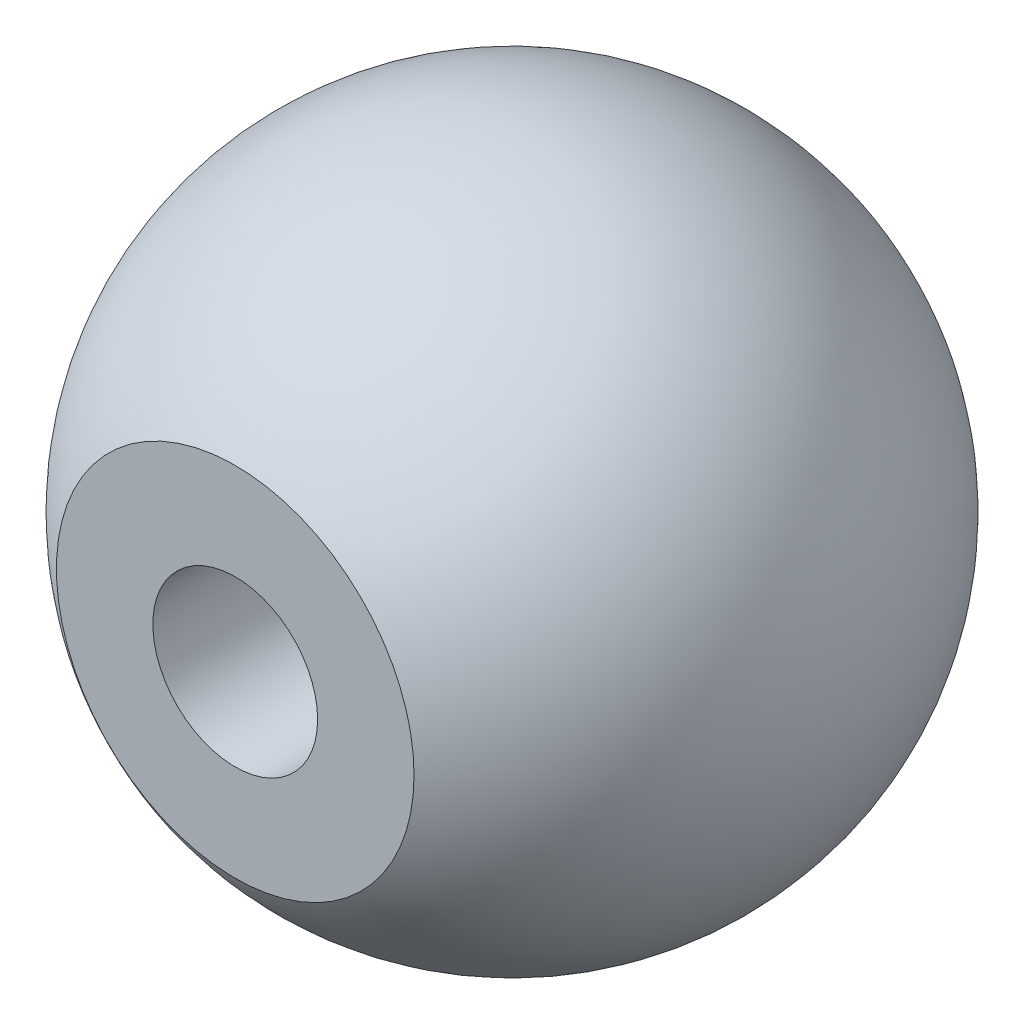
ISO-10303-21;
HEADER;
FILE_DESCRIPTION(('STEP AP214'),'2;1');
FILE_NAME('part.step','',(''),(''),'','','');
FILE_SCHEMA(('AUTOMOTIVE_DESIGN { 1 0 10303 214 1 1 1 1 }'));
ENDSEC;
DATA;
#1=APPLICATION_CONTEXT('core data for automotive mechanical design processes');
#2=APPLICATION_PROTOCOL_DEFINITION('international standard','automotive_design',2000,#1);
#3=PRODUCT_CONTEXT('',#1,'mechanical');
#4=PRODUCT('Part','Part','',(#3));
#5=PRODUCT_RELATED_PRODUCT_CATEGORY('part','',(#4));
#6=PRODUCT_DEFINITION_FORMATION('','',#4);
#7=PRODUCT_DEFINITION_CONTEXT('part definition',#1,'design');
#8=PRODUCT_DEFINITION('design','',#6,#7);
#9=PRODUCT_DEFINITION_SHAPE('','',#8);
#10=(LENGTH_UNIT() NAMED_UNIT(*) SI_UNIT(.MILLI.,.METRE.));
#11=(NAMED_UNIT(*) PLANE_ANGLE_UNIT() SI_UNIT($,.RADIAN.));
#12=(NAMED_UNIT(*) SI_UNIT($,.STERADIAN.) SOLID_ANGLE_UNIT());
#13=UNCERTAINTY_MEASURE_WITH_UNIT(LENGTH_MEASURE(1.E-05),#10,'distance_accuracy_value','');
#14=(GEOMETRIC_REPRESENTATION_CONTEXT(3) GLOBAL_UNCERTAINTY_ASSIGNED_CONTEXT((#13)) GLOBAL_UNIT_ASSIGNED_CONTEXT((#10,
#11,#12)) REPRESENTATION_CONTEXT('',''));
#15=CARTESIAN_POINT('',(0.,0.,0.));
#16=DIRECTION('',(0.,0.,1.));
#17=DIRECTION('',(1.,0.,0.));
#18=AXIS2_PLACEMENT_3D('',#15,#16,#17);
#19=CARTESIAN_POINT('',(0.,0.,0.));
#20=DIRECTION('',(-1.,0.,0.));
#21=DIRECTION('',(0.,0.,-1.));
#22=AXIS2_PLACEMENT_3D('',#19,#20,#21);
#23=SPHERICAL_SURFACE('',#22,19.05);
#24=CARTESIAN_POINT('',(0.,0.,0.));
#25=DIRECTION('',(0.,0.,1.));
#26=DIRECTION('',(1.,0.,0.));
#27=AXIS2_PLACEMENT_3D('',#24,#25,#26);
#28=SPHERICAL_SURFACE('',#27,19.05);
#29=CARTESIAN_POINT('',(0.,0.,16.002));
#30=DIRECTION('',(0.,0.,1.));
#31=DIRECTION('',(1.,0.,0.));
#32=AXIS2_PLACEMENT_3D('',#29,#30,#31);
#33=CIRCLE('',#32,10.3362708942829);
#34=CARTESIAN_POINT('',(10.3362708942829,0.,16.002));
#35=VERTEX_POINT('',#34);
#36=EDGE_CURVE('E10',#35,#35,#33,.F.);
#37=ORIENTED_EDGE('',*,*,#36,.T.);
#38=EDGE_LOOP('',(#37));
#39=FACE_BOUND('',#38,.T.);
#40=ADVANCED_FACE('F42',(#39),#28,.T.);
#41=CARTESIAN_POINT('',(0.,0.,16.002));
#42=DIRECTION('',(0.,0.,1.));
#43=DIRECTION('',(1.,0.,0.));
#44=AXIS2_PLACEMENT_3D('',#41,#42,#43);
#45=PLANE('',#44);
#46=CARTESIAN_POINT('',(0.,0.,16.002));
#47=DIRECTION('',(0.,0.,1.));
#48=DIRECTION('',(1.,0.,0.));
#49=AXIS2_PLACEMENT_3D('',#46,#47,#48);
#50=CIRCLE('',#49,4.7625);
#51=CARTESIAN_POINT('',(4.7625,0.,16.002));
#52=VERTEX_POINT('',#51);
#53=EDGE_CURVE('E56',#52,#52,#50,.T.);
#54=ORIENTED_EDGE('',*,*,#53,.F.);
#55=EDGE_LOOP('',(#54));
#56=FACE_BOUND('',#55,.T.);
#57=ORIENTED_EDGE('',*,*,#36,.F.);
#58=EDGE_LOOP('',(#57));
#59=FACE_BOUND('',#58,.T.);
#60=ADVANCED_FACE('F70',(#56,#59),#45,.T.);
#61=CARTESIAN_POINT('',(0.,0.,3.302));
#62=DIRECTION('',(0.,0.,1.));
#63=DIRECTION('',(1.,0.,0.));
#64=AXIS2_PLACEMENT_3D('',#61,#62,#63);
#65=CYLINDRICAL_SURFACE('',#64,4.7625);
#66=CARTESIAN_POINT('',(0.,0.,3.302));
#67=DIRECTION('',(0.,0.,1.));
#68=DIRECTION('',(1.,0.,0.));
#69=AXIS2_PLACEMENT_3D('',#66,#67,#68);
#70=CIRCLE('',#69,4.7625);
#71=CARTESIAN_POINT('',(4.7625,0.,3.302));
#72=VERTEX_POINT('',#71);
#73=EDGE_CURVE('E49',#72,#72,#70,.T.);
#74=ORIENTED_EDGE('',*,*,#73,.F.);
#75=EDGE_LOOP('',(#74));
#76=FACE_BOUND('',#75,.T.);
#77=ORIENTED_EDGE('',*,*,#53,.T.);
#78=EDGE_LOOP('',(#77));
#79=FACE_BOUND('',#78,.T.);
#80=ADVANCED_FACE('F68',(#76,#79),#65,.F.);
#81=CARTESIAN_POINT('',(0.,0.,3.302));
#82=DIRECTION('',(0.,0.,1.));
#83=DIRECTION('',(1.,0.,0.));
#84=AXIS2_PLACEMENT_3D('',#81,#82,#83);
#85=PLANE('',#84);
#86=ORIENTED_EDGE('',*,*,#73,.T.);
#87=EDGE_LOOP('',(#86));
#88=FACE_BOUND('',#87,.T.);
#89=ADVANCED_FACE('F77',(#88),#85,.T.);
#90=CLOSED_SHELL('',(#40,#60,#80,#89));
#91=MANIFOLD_SOLID_BREP('B2',#90);
#92=ADVANCED_BREP_SHAPE_REPRESENTATION('',(#18,#91),#14);
#93=SHAPE_DEFINITION_REPRESENTATION(#9,#92);
ENDSEC;
END-ISO-10303-21;
